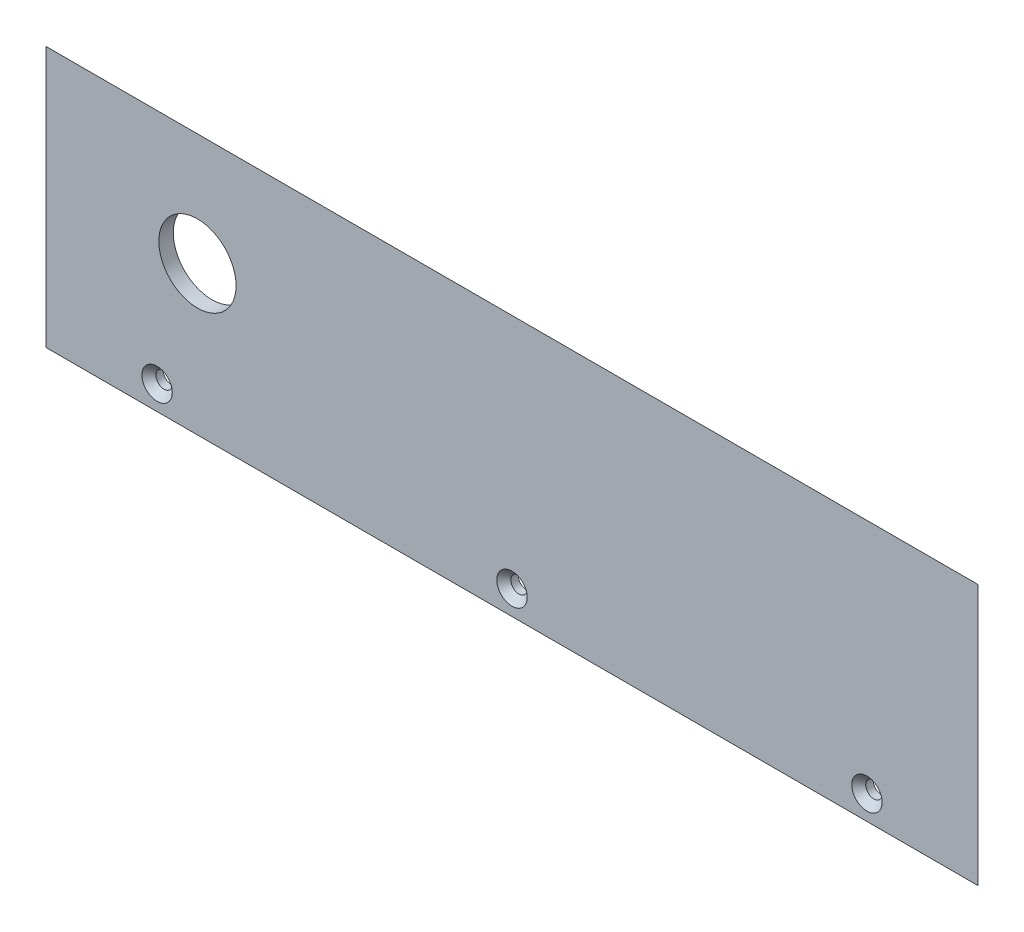
ISO-10303-21;
HEADER;
FILE_DESCRIPTION(('STEP AP214'),'2;1');
FILE_NAME('part.step','',(''),(''),'','','');
FILE_SCHEMA(('AUTOMOTIVE_DESIGN { 1 0 10303 214 1 1 1 1 }'));
ENDSEC;
DATA;
#1=APPLICATION_CONTEXT('core data for automotive mechanical design processes');
#2=APPLICATION_PROTOCOL_DEFINITION('international standard','automotive_design',2000,#1);
#3=PRODUCT_CONTEXT('',#1,'mechanical');
#4=PRODUCT('Part','Part','',(#3));
#5=PRODUCT_RELATED_PRODUCT_CATEGORY('part','',(#4));
#6=PRODUCT_DEFINITION_FORMATION('','',#4);
#7=PRODUCT_DEFINITION_CONTEXT('part definition',#1,'design');
#8=PRODUCT_DEFINITION('design','',#6,#7);
#9=PRODUCT_DEFINITION_SHAPE('','',#8);
#10=(LENGTH_UNIT() NAMED_UNIT(*) SI_UNIT(.MILLI.,.METRE.));
#11=(NAMED_UNIT(*) PLANE_ANGLE_UNIT() SI_UNIT($,.RADIAN.));
#12=(NAMED_UNIT(*) SI_UNIT($,.STERADIAN.) SOLID_ANGLE_UNIT());
#13=UNCERTAINTY_MEASURE_WITH_UNIT(LENGTH_MEASURE(1.E-05),#10,'distance_accuracy_value','');
#14=(GEOMETRIC_REPRESENTATION_CONTEXT(3) GLOBAL_UNCERTAINTY_ASSIGNED_CONTEXT((#13)) GLOBAL_UNIT_ASSIGNED_CONTEXT((#10,
#11,#12)) REPRESENTATION_CONTEXT('',''));
#15=CARTESIAN_POINT('',(0.,0.,0.));
#16=DIRECTION('',(0.,0.,1.));
#17=DIRECTION('',(1.,0.,0.));
#18=AXIS2_PLACEMENT_3D('',#15,#16,#17);
#19=CARTESIAN_POINT('',(0.,0.,3.));
#20=DIRECTION('',(0.,1.,0.));
#21=DIRECTION('',(0.,0.,1.));
#22=AXIS2_PLACEMENT_3D('',#19,#20,#21);
#23=PLANE('',#22);
#24=DIRECTION('',(1.,0.,0.));
#25=VECTOR('',#24,1.);
#26=CARTESIAN_POINT('',(0.,0.,3.));
#27=LINE('',#26,#25);
#28=CARTESIAN_POINT('',(0.,0.,3.));
#29=VERTEX_POINT('',#28);
#30=CARTESIAN_POINT('',(193.,0.,3.));
#31=VERTEX_POINT('',#30);
#32=EDGE_CURVE('E83',#29,#31,#27,.T.);
#33=ORIENTED_EDGE('',*,*,#32,.F.);
#34=DIRECTION('',(0.707106781186551,0.,-0.707106781186544));
#35=VECTOR('',#34,1.);
#36=CARTESIAN_POINT('',(0.,0.,2.99999999999998));
#37=LINE('',#36,#35);
#38=CARTESIAN_POINT('',(3.,0.,0.));
#39=VERTEX_POINT('',#38);
#40=EDGE_CURVE('E71',#29,#39,#37,.T.);
#41=ORIENTED_EDGE('',*,*,#40,.T.);
#42=DIRECTION('',(1.,0.,0.));
#43=VECTOR('',#42,1.);
#44=CARTESIAN_POINT('',(0.,0.,0.));
#45=LINE('',#44,#43);
#46=CARTESIAN_POINT('',(190.,0.,0.));
#47=VERTEX_POINT('',#46);
#48=EDGE_CURVE('E93',#39,#47,#45,.T.);
#49=ORIENTED_EDGE('',*,*,#48,.T.);
#50=DIRECTION('',(0.707106781186551,0.,0.707106781186544));
#51=VECTOR('',#50,1.);
#52=CARTESIAN_POINT('',(193.,0.,2.99999999999998));
#53=LINE('',#52,#51);
#54=EDGE_CURVE('E80',#47,#31,#53,.T.);
#55=ORIENTED_EDGE('',*,*,#54,.T.);
#56=EDGE_LOOP('',(#33,#41,#49,#55));
#57=FACE_BOUND('',#56,.T.);
#58=ADVANCED_FACE('F33',(#57),#23,.F.);
#59=CARTESIAN_POINT('',(0.,0.,3.));
#60=DIRECTION('',(0.,0.,-1.));
#61=DIRECTION('',(-1.,0.,0.));
#62=AXIS2_PLACEMENT_3D('',#59,#60,#61);
#63=PLANE('',#62);
#64=CARTESIAN_POINT('',(31.36,30.75,3.));
#65=DIRECTION('',(0.,0.,1.));
#66=DIRECTION('',(1.,0.,0.));
#67=AXIS2_PLACEMENT_3D('',#64,#65,#66);
#68=CIRCLE('',#67,8.);
#69=CARTESIAN_POINT('',(39.36,30.75,3.));
#70=VERTEX_POINT('',#69);
#71=EDGE_CURVE('E237',#70,#70,#68,.T.);
#72=ORIENTED_EDGE('',*,*,#71,.F.);
#73=EDGE_LOOP('',(#72));
#74=FACE_BOUND('',#73,.T.);
#75=CARTESIAN_POINT('',(23.,5.,3.));
#76=DIRECTION('',(0.,0.,1.));
#77=DIRECTION('',(1.,0.,0.));
#78=AXIS2_PLACEMENT_3D('',#75,#76,#77);
#79=CIRCLE('',#78,3.15);
#80=CARTESIAN_POINT('',(26.15,5.,3.));
#81=VERTEX_POINT('',#80);
#82=EDGE_CURVE('E239',#81,#81,#79,.T.);
#83=ORIENTED_EDGE('',*,*,#82,.F.);
#84=EDGE_LOOP('',(#83));
#85=FACE_BOUND('',#84,.T.);
#86=CARTESIAN_POINT('',(96.5,5.,3.));
#87=DIRECTION('',(0.,0.,1.));
#88=DIRECTION('',(1.,0.,0.));
#89=AXIS2_PLACEMENT_3D('',#86,#87,#88);
#90=CIRCLE('',#89,3.15);
#91=CARTESIAN_POINT('',(99.65,5.,3.));
#92=VERTEX_POINT('',#91);
#93=EDGE_CURVE('E249',#92,#92,#90,.T.);
#94=ORIENTED_EDGE('',*,*,#93,.F.);
#95=EDGE_LOOP('',(#94));
#96=FACE_BOUND('',#95,.T.);
#97=CARTESIAN_POINT('',(170.,5.,3.));
#98=DIRECTION('',(0.,0.,1.));
#99=DIRECTION('',(1.,0.,0.));
#100=AXIS2_PLACEMENT_3D('',#97,#98,#99);
#101=CIRCLE('',#100,3.15000000000001);
#102=CARTESIAN_POINT('',(173.15,5.,3.));
#103=VERTEX_POINT('',#102);
#104=EDGE_CURVE('E258',#103,#103,#101,.T.);
#105=ORIENTED_EDGE('',*,*,#104,.F.);
#106=EDGE_LOOP('',(#105));
#107=FACE_BOUND('',#106,.T.);
#108=DIRECTION('',(0.,-1.,0.));
#109=VECTOR('',#108,1.);
#110=CARTESIAN_POINT('',(0.,0.,3.));
#111=LINE('',#110,#109);
#112=CARTESIAN_POINT('',(0.,54.,3.));
#113=VERTEX_POINT('',#112);
#114=EDGE_CURVE('E76',#113,#29,#111,.T.);
#115=ORIENTED_EDGE('',*,*,#114,.T.);
#116=ORIENTED_EDGE('',*,*,#32,.T.);
#117=DIRECTION('',(0.,1.,0.));
#118=VECTOR('',#117,1.);
#119=CARTESIAN_POINT('',(193.,0.,3.));
#120=LINE('',#119,#118);
#121=CARTESIAN_POINT('',(193.,54.,3.));
#122=VERTEX_POINT('',#121);
#123=EDGE_CURVE('E87',#31,#122,#120,.T.);
#124=ORIENTED_EDGE('',*,*,#123,.T.);
#125=DIRECTION('',(-1.,0.,0.));
#126=VECTOR('',#125,1.);
#127=CARTESIAN_POINT('',(0.,54.,3.));
#128=LINE('',#127,#126);
#129=EDGE_CURVE('E91',#122,#113,#128,.T.);
#130=ORIENTED_EDGE('',*,*,#129,.T.);
#131=EDGE_LOOP('',(#115,#116,#124,#130));
#132=FACE_BOUND('',#131,.T.);
#133=ADVANCED_FACE('F89',(#74,#85,#96,#107,#132),#63,.F.);
#134=CARTESIAN_POINT('',(0.,0.,0.));
#135=DIRECTION('',(0.,0.,-1.));
#136=DIRECTION('',(-1.,0.,0.));
#137=AXIS2_PLACEMENT_3D('',#134,#135,#136);
#138=PLANE('',#137);
#139=CARTESIAN_POINT('',(31.36,30.75,0.));
#140=DIRECTION('',(0.,0.,-1.));
#141=DIRECTION('',(-1.,0.,0.));
#142=AXIS2_PLACEMENT_3D('',#139,#140,#141);
#143=CIRCLE('',#142,8.);
#144=CARTESIAN_POINT('',(23.36,30.75,0.));
#145=VERTEX_POINT('',#144);
#146=EDGE_CURVE('E37',#145,#145,#143,.T.);
#147=ORIENTED_EDGE('',*,*,#146,.F.);
#148=EDGE_LOOP('',(#147));
#149=FACE_BOUND('',#148,.T.);
#150=CARTESIAN_POINT('',(23.,5.,0.));
#151=DIRECTION('',(0.,0.,1.));
#152=DIRECTION('',(1.,0.,0.));
#153=AXIS2_PLACEMENT_3D('',#150,#151,#152);
#154=CIRCLE('',#153,1.7);
#155=CARTESIAN_POINT('',(24.7,5.,0.));
#156=VERTEX_POINT('',#155);
#157=EDGE_CURVE('E246',#156,#156,#154,.T.);
#158=ORIENTED_EDGE('',*,*,#157,.T.);
#159=EDGE_LOOP('',(#158));
#160=FACE_BOUND('',#159,.T.);
#161=CARTESIAN_POINT('',(96.5,5.,0.));
#162=DIRECTION('',(0.,0.,1.));
#163=DIRECTION('',(1.,0.,0.));
#164=AXIS2_PLACEMENT_3D('',#161,#162,#163);
#165=CIRCLE('',#164,1.69999999999999);
#166=CARTESIAN_POINT('',(98.2,5.,0.));
#167=VERTEX_POINT('',#166);
#168=EDGE_CURVE('E255',#167,#167,#165,.T.);
#169=ORIENTED_EDGE('',*,*,#168,.T.);
#170=EDGE_LOOP('',(#169));
#171=FACE_BOUND('',#170,.T.);
#172=CARTESIAN_POINT('',(170.,5.,0.));
#173=DIRECTION('',(0.,0.,1.));
#174=DIRECTION('',(1.,0.,0.));
#175=AXIS2_PLACEMENT_3D('',#172,#173,#174);
#176=CIRCLE('',#175,1.70000000000001);
#177=CARTESIAN_POINT('',(171.7,5.,0.));
#178=VERTEX_POINT('',#177);
#179=EDGE_CURVE('E98',#178,#178,#176,.T.);
#180=ORIENTED_EDGE('',*,*,#179,.T.);
#181=EDGE_LOOP('',(#180));
#182=FACE_BOUND('',#181,.T.);
#183=ORIENTED_EDGE('',*,*,#48,.F.);
#184=DIRECTION('',(0.,1.,0.));
#185=VECTOR('',#184,1.);
#186=CARTESIAN_POINT('',(3.,54.,0.));
#187=LINE('',#186,#185);
#188=CARTESIAN_POINT('',(3.,51.,0.));
#189=VERTEX_POINT('',#188);
#190=EDGE_CURVE('E11',#39,#189,#187,.T.);
#191=ORIENTED_EDGE('',*,*,#190,.T.);
#192=DIRECTION('',(1.,0.,0.));
#193=VECTOR('',#192,1.);
#194=CARTESIAN_POINT('',(193.,51.,0.));
#195=LINE('',#194,#193);
#196=CARTESIAN_POINT('',(190.,51.,0.));
#197=VERTEX_POINT('',#196);
#198=EDGE_CURVE('E42',#189,#197,#195,.T.);
#199=ORIENTED_EDGE('',*,*,#198,.T.);
#200=DIRECTION('',(0.,-1.,0.));
#201=VECTOR('',#200,1.);
#202=CARTESIAN_POINT('',(190.,0.,0.));
#203=LINE('',#202,#201);
#204=EDGE_CURVE('E79',#197,#47,#203,.T.);
#205=ORIENTED_EDGE('',*,*,#204,.T.);
#206=EDGE_LOOP('',(#183,#191,#199,#205));
#207=FACE_BOUND('',#206,.T.);
#208=ADVANCED_FACE('F112',(#149,#160,#171,#182,#207),#138,.T.);
#209=CARTESIAN_POINT('',(193.,0.,2.99999999999998));
#210=DIRECTION('',(0.707106781186544,0.,-0.707106781186551));
#211=DIRECTION('',(0.,-1.,0.));
#212=AXIS2_PLACEMENT_3D('',#209,#210,#211);
#213=PLANE('',#212);
#214=ORIENTED_EDGE('',*,*,#54,.F.);
#215=ORIENTED_EDGE('',*,*,#204,.F.);
#216=DIRECTION('',(0.577350269189628,0.577350269189628,0.577350269189622));
#217=VECTOR('',#216,1.);
#218=CARTESIAN_POINT('',(175.,35.9999999999999,-15.));
#219=LINE('',#218,#217);
#220=EDGE_CURVE('E95',#122,#197,#219,.F.);
#221=ORIENTED_EDGE('',*,*,#220,.F.);
#222=ORIENTED_EDGE('',*,*,#123,.F.);
#223=EDGE_LOOP('',(#214,#215,#221,#222));
#224=FACE_BOUND('',#223,.T.);
#225=ADVANCED_FACE('F35',(#224),#213,.T.);
#226=CARTESIAN_POINT('',(0.,54.,2.99999999999998));
#227=DIRECTION('',(0.,0.707106781186544,-0.707106781186551));
#228=DIRECTION('',(1.,0.,0.));
#229=AXIS2_PLACEMENT_3D('',#226,#227,#228);
#230=PLANE('',#229);
#231=ORIENTED_EDGE('',*,*,#220,.T.);
#232=ORIENTED_EDGE('',*,*,#198,.F.);
#233=DIRECTION('',(-0.577350269189628,0.577350269189628,0.577350269189622));
#234=VECTOR('',#233,1.);
#235=CARTESIAN_POINT('',(0.,54.,2.99999999999998));
#236=LINE('',#235,#234);
#237=EDGE_CURVE('E106',#113,#189,#236,.F.);
#238=ORIENTED_EDGE('',*,*,#237,.F.);
#239=ORIENTED_EDGE('',*,*,#129,.F.);
#240=EDGE_LOOP('',(#231,#232,#238,#239));
#241=FACE_BOUND('',#240,.T.);
#242=ADVANCED_FACE('F110',(#241),#230,.T.);
#243=CARTESIAN_POINT('',(0.,0.,2.99999999999998));
#244=DIRECTION('',(-0.707106781186544,0.,-0.707106781186551));
#245=DIRECTION('',(0.,1.,0.));
#246=AXIS2_PLACEMENT_3D('',#243,#244,#245);
#247=PLANE('',#246);
#248=ORIENTED_EDGE('',*,*,#237,.T.);
#249=ORIENTED_EDGE('',*,*,#190,.F.);
#250=ORIENTED_EDGE('',*,*,#40,.F.);
#251=ORIENTED_EDGE('',*,*,#114,.F.);
#252=EDGE_LOOP('',(#248,#249,#250,#251));
#253=FACE_BOUND('',#252,.T.);
#254=ADVANCED_FACE('F74',(#253),#247,.T.);
#255=CARTESIAN_POINT('',(170.,5.,3.));
#256=DIRECTION('',(0.,0.,1.));
#257=DIRECTION('',(1.,0.,0.));
#258=AXIS2_PLACEMENT_3D('',#255,#256,#257);
#259=CYLINDRICAL_SURFACE('',#258,1.70000000000001);
#260=ORIENTED_EDGE('',*,*,#179,.F.);
#261=EDGE_LOOP('',(#260));
#262=FACE_BOUND('',#261,.T.);
#263=CARTESIAN_POINT('',(170.,5.,1.55));
#264=DIRECTION('',(0.,0.,1.));
#265=DIRECTION('',(1.,0.,0.));
#266=AXIS2_PLACEMENT_3D('',#263,#264,#265);
#267=CIRCLE('',#266,1.70000000000001);
#268=CARTESIAN_POINT('',(171.7,5.,1.55));
#269=VERTEX_POINT('',#268);
#270=EDGE_CURVE('E260',#269,#269,#267,.T.);
#271=ORIENTED_EDGE('',*,*,#270,.T.);
#272=EDGE_LOOP('',(#271));
#273=FACE_BOUND('',#272,.T.);
#274=ADVANCED_FACE('F130',(#262,#273),#259,.F.);
#275=CARTESIAN_POINT('',(170.,5.,3.));
#276=DIRECTION('',(0.,0.,1.));
#277=DIRECTION('',(1.,0.,0.));
#278=AXIS2_PLACEMENT_3D('',#275,#276,#277);
#279=CONICAL_SURFACE('',#278,3.15000000000001,0.78539816339745);
#280=ORIENTED_EDGE('',*,*,#270,.F.);
#281=EDGE_LOOP('',(#280));
#282=FACE_BOUND('',#281,.T.);
#283=ORIENTED_EDGE('',*,*,#104,.T.);
#284=EDGE_LOOP('',(#283));
#285=FACE_BOUND('',#284,.T.);
#286=ADVANCED_FACE('F146',(#282,#285),#279,.F.);
#287=CARTESIAN_POINT('',(96.5,5.,3.));
#288=DIRECTION('',(0.,0.,1.));
#289=DIRECTION('',(1.,0.,0.));
#290=AXIS2_PLACEMENT_3D('',#287,#288,#289);
#291=CYLINDRICAL_SURFACE('',#290,1.69999999999999);
#292=ORIENTED_EDGE('',*,*,#168,.F.);
#293=EDGE_LOOP('',(#292));
#294=FACE_BOUND('',#293,.T.);
#295=CARTESIAN_POINT('',(96.5,5.,1.55));
#296=DIRECTION('',(0.,0.,1.));
#297=DIRECTION('',(1.,0.,0.));
#298=AXIS2_PLACEMENT_3D('',#295,#296,#297);
#299=CIRCLE('',#298,1.69999999999999);
#300=CARTESIAN_POINT('',(98.2,5.,1.55));
#301=VERTEX_POINT('',#300);
#302=EDGE_CURVE('E252',#301,#301,#299,.T.);
#303=ORIENTED_EDGE('',*,*,#302,.T.);
#304=EDGE_LOOP('',(#303));
#305=FACE_BOUND('',#304,.T.);
#306=ADVANCED_FACE('F154',(#294,#305),#291,.F.);
#307=CARTESIAN_POINT('',(96.5,5.,3.));
#308=DIRECTION('',(0.,0.,1.));
#309=DIRECTION('',(1.,0.,0.));
#310=AXIS2_PLACEMENT_3D('',#307,#308,#309);
#311=CONICAL_SURFACE('',#310,3.15,0.78539816339745);
#312=ORIENTED_EDGE('',*,*,#302,.F.);
#313=EDGE_LOOP('',(#312));
#314=FACE_BOUND('',#313,.T.);
#315=ORIENTED_EDGE('',*,*,#93,.T.);
#316=EDGE_LOOP('',(#315));
#317=FACE_BOUND('',#316,.T.);
#318=ADVANCED_FACE('F162',(#314,#317),#311,.F.);
#319=CARTESIAN_POINT('',(23.,5.,3.));
#320=DIRECTION('',(0.,0.,1.));
#321=DIRECTION('',(1.,0.,0.));
#322=AXIS2_PLACEMENT_3D('',#319,#320,#321);
#323=CYLINDRICAL_SURFACE('',#322,1.7);
#324=ORIENTED_EDGE('',*,*,#157,.F.);
#325=EDGE_LOOP('',(#324));
#326=FACE_BOUND('',#325,.T.);
#327=CARTESIAN_POINT('',(23.,5.,1.55));
#328=DIRECTION('',(0.,0.,1.));
#329=DIRECTION('',(1.,0.,0.));
#330=AXIS2_PLACEMENT_3D('',#327,#328,#329);
#331=CIRCLE('',#330,1.7);
#332=CARTESIAN_POINT('',(24.7,5.,1.55));
#333=VERTEX_POINT('',#332);
#334=EDGE_CURVE('E243',#333,#333,#331,.T.);
#335=ORIENTED_EDGE('',*,*,#334,.T.);
#336=EDGE_LOOP('',(#335));
#337=FACE_BOUND('',#336,.T.);
#338=ADVANCED_FACE('F170',(#326,#337),#323,.F.);
#339=CARTESIAN_POINT('',(23.,5.,3.));
#340=DIRECTION('',(0.,0.,1.));
#341=DIRECTION('',(1.,0.,0.));
#342=AXIS2_PLACEMENT_3D('',#339,#340,#341);
#343=CONICAL_SURFACE('',#342,3.15,0.785398163397448);
#344=ORIENTED_EDGE('',*,*,#334,.F.);
#345=EDGE_LOOP('',(#344));
#346=FACE_BOUND('',#345,.T.);
#347=ORIENTED_EDGE('',*,*,#82,.T.);
#348=EDGE_LOOP('',(#347));
#349=FACE_BOUND('',#348,.T.);
#350=ADVANCED_FACE('F178',(#346,#349),#343,.F.);
#351=CARTESIAN_POINT('',(31.36,30.75,-7.));
#352=DIRECTION('',(0.,0.,1.));
#353=DIRECTION('',(1.,0.,0.));
#354=AXIS2_PLACEMENT_3D('',#351,#352,#353);
#355=CYLINDRICAL_SURFACE('',#354,8.);
#356=ORIENTED_EDGE('',*,*,#146,.T.);
#357=EDGE_LOOP('',(#356));
#358=FACE_BOUND('',#357,.T.);
#359=ORIENTED_EDGE('',*,*,#71,.T.);
#360=EDGE_LOOP('',(#359));
#361=FACE_BOUND('',#360,.T.);
#362=ADVANCED_FACE('F186',(#358,#361),#355,.F.);
#363=CLOSED_SHELL('',(#58,#133,#208,#225,#242,#254,#274,#286,#306,#318,#338,#350,#362));
#364=MANIFOLD_SOLID_BREP('B2',#363);
#365=ADVANCED_BREP_SHAPE_REPRESENTATION('',(#18,#364),#14);
#366=SHAPE_DEFINITION_REPRESENTATION(#9,#365);
ENDSEC;
END-ISO-10303-21;
